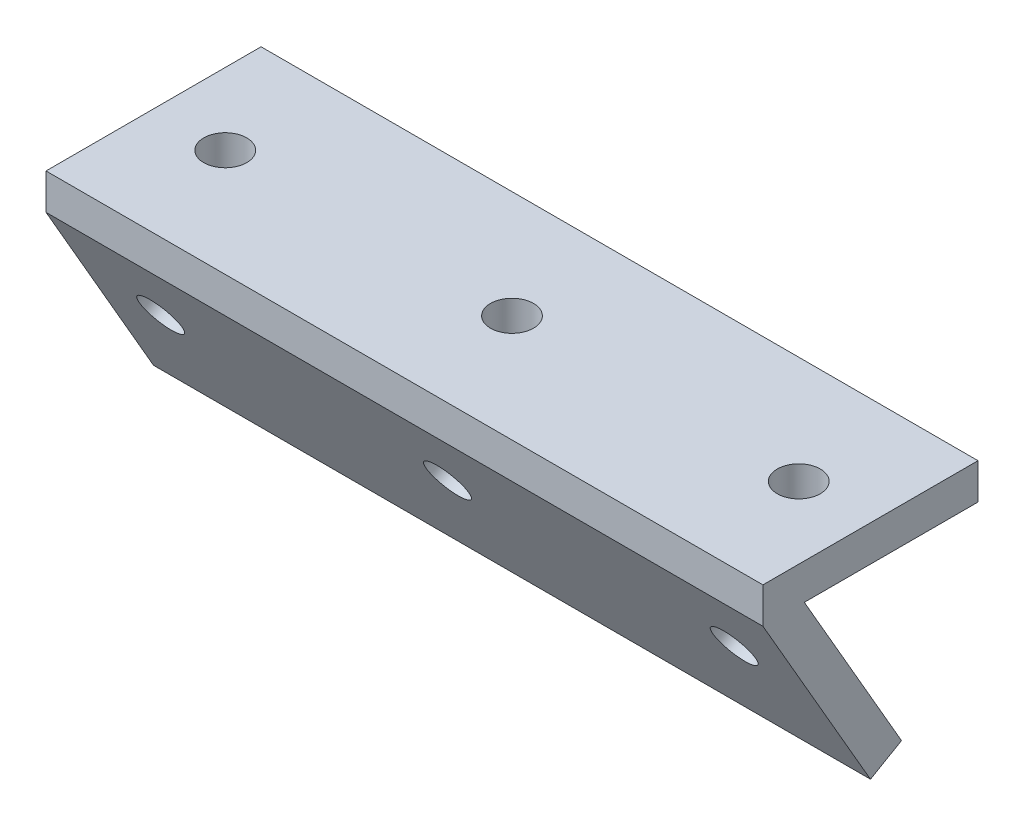
ISO-10303-21;
HEADER;
FILE_DESCRIPTION(('STEP AP214'),'2;1');
FILE_NAME('part.step','',(''),(''),'','','');
FILE_SCHEMA(('AUTOMOTIVE_DESIGN { 1 0 10303 214 1 1 1 1 }'));
ENDSEC;
DATA;
#1=APPLICATION_CONTEXT('core data for automotive mechanical design processes');
#2=APPLICATION_PROTOCOL_DEFINITION('international standard','automotive_design',2000,#1);
#3=PRODUCT_CONTEXT('',#1,'mechanical');
#4=PRODUCT('Part','Part','',(#3));
#5=PRODUCT_RELATED_PRODUCT_CATEGORY('part','',(#4));
#6=PRODUCT_DEFINITION_FORMATION('','',#4);
#7=PRODUCT_DEFINITION_CONTEXT('part definition',#1,'design');
#8=PRODUCT_DEFINITION('design','',#6,#7);
#9=PRODUCT_DEFINITION_SHAPE('','',#8);
#10=(LENGTH_UNIT() NAMED_UNIT(*) SI_UNIT(.MILLI.,.METRE.));
#11=(NAMED_UNIT(*) PLANE_ANGLE_UNIT() SI_UNIT($,.RADIAN.));
#12=(NAMED_UNIT(*) SI_UNIT($,.STERADIAN.) SOLID_ANGLE_UNIT());
#13=UNCERTAINTY_MEASURE_WITH_UNIT(LENGTH_MEASURE(1.E-05),#10,'distance_accuracy_value','');
#14=(GEOMETRIC_REPRESENTATION_CONTEXT(3) GLOBAL_UNCERTAINTY_ASSIGNED_CONTEXT((#13)) GLOBAL_UNIT_ASSIGNED_CONTEXT((#10,
#11,#12)) REPRESENTATION_CONTEXT('',''));
#15=CARTESIAN_POINT('',(0.,0.,0.));
#16=DIRECTION('',(0.,0.,1.));
#17=DIRECTION('',(1.,0.,0.));
#18=AXIS2_PLACEMENT_3D('',#15,#16,#17);
#19=CARTESIAN_POINT('',(0.,-0.0001,0.));
#20=DIRECTION('',(0.,-1.,0.));
#21=DIRECTION('',(0.,0.,-1.));
#22=AXIS2_PLACEMENT_3D('',#19,#20,#21);
#23=PLANE('',#22);
#24=CARTESIAN_POINT('',(-40.,-0.0001,0.));
#25=DIRECTION('',(0.,-1.,0.));
#26=DIRECTION('',(0.,0.,-1.));
#27=AXIS2_PLACEMENT_3D('',#24,#25,#26);
#28=CIRCLE('',#27,3.);
#29=CARTESIAN_POINT('',(-40.,-0.0001,-3.00000000000001));
#30=VERTEX_POINT('',#29);
#31=EDGE_CURVE('E173',#30,#30,#28,.T.);
#32=ORIENTED_EDGE('',*,*,#31,.F.);
#33=EDGE_LOOP('',(#32));
#34=FACE_BOUND('',#33,.T.);
#35=CARTESIAN_POINT('',(40.,-0.0001,0.));
#36=DIRECTION('',(0.,-1.,0.));
#37=DIRECTION('',(0.,0.,-1.));
#38=AXIS2_PLACEMENT_3D('',#35,#36,#37);
#39=CIRCLE('',#38,3.);
#40=CARTESIAN_POINT('',(40.,-0.0001,-3.));
#41=VERTEX_POINT('',#40);
#42=EDGE_CURVE('E177',#41,#41,#39,.T.);
#43=ORIENTED_EDGE('',*,*,#42,.F.);
#44=EDGE_LOOP('',(#43));
#45=FACE_BOUND('',#44,.T.);
#46=CARTESIAN_POINT('',(0.,-0.0001,0.));
#47=DIRECTION('',(0.,-1.,0.));
#48=DIRECTION('',(0.,0.,-1.));
#49=AXIS2_PLACEMENT_3D('',#46,#47,#48);
#50=CIRCLE('',#49,3.);
#51=CARTESIAN_POINT('',(0.,-0.0001,-3.));
#52=VERTEX_POINT('',#51);
#53=EDGE_CURVE('E160',#52,#52,#50,.T.);
#54=ORIENTED_EDGE('',*,*,#53,.F.);
#55=EDGE_LOOP('',(#54));
#56=FACE_BOUND('',#55,.T.);
#57=DIRECTION('',(0.,0.,-1.));
#58=VECTOR('',#57,1.);
#59=CARTESIAN_POINT('',(50.,-0.0001,15.));
#60=LINE('',#59,#58);
#61=CARTESIAN_POINT('',(50.,-9.99999999994061E-05,9.22638183804991));
#62=VERTEX_POINT('',#61);
#63=CARTESIAN_POINT('',(50.,-0.0001,-15.));
#64=VERTEX_POINT('',#63);
#65=EDGE_CURVE('E64',#62,#64,#60,.T.);
#66=ORIENTED_EDGE('',*,*,#65,.F.);
#67=DIRECTION('',(-1.,0.,0.));
#68=VECTOR('',#67,1.);
#69=CARTESIAN_POINT('',(0.,-0.0001,9.22638183804991));
#70=LINE('',#69,#68);
#71=CARTESIAN_POINT('',(-50.,-0.0001,9.22638183804991));
#72=VERTEX_POINT('',#71);
#73=EDGE_CURVE('E11',#62,#72,#70,.T.);
#74=ORIENTED_EDGE('',*,*,#73,.T.);
#75=DIRECTION('',(0.,0.,-1.));
#76=VECTOR('',#75,1.);
#77=CARTESIAN_POINT('',(-50.,-0.0001,15.));
#78=LINE('',#77,#76);
#79=CARTESIAN_POINT('',(-50.,-0.0001,-15.));
#80=VERTEX_POINT('',#79);
#81=EDGE_CURVE('E104',#72,#80,#78,.T.);
#82=ORIENTED_EDGE('',*,*,#81,.T.);
#83=DIRECTION('',(1.,0.,0.));
#84=VECTOR('',#83,1.);
#85=CARTESIAN_POINT('',(-50.,-0.0001,-15.));
#86=LINE('',#85,#84);
#87=EDGE_CURVE('E143',#80,#64,#86,.T.);
#88=ORIENTED_EDGE('',*,*,#87,.T.);
#89=EDGE_LOOP('',(#66,#74,#82,#88));
#90=FACE_BOUND('',#89,.T.);
#91=ADVANCED_FACE('F40',(#34,#45,#56,#90),#23,.T.);
#92=CARTESIAN_POINT('',(-50.,-0.0001,15.));
#93=DIRECTION('',(1.,0.,0.));
#94=DIRECTION('',(0.,0.,-1.));
#95=AXIS2_PLACEMENT_3D('',#92,#93,#94);
#96=PLANE('',#95);
#97=DIRECTION('',(0.,-0.86602540378444,-0.499999999999998));
#98=VECTOR('',#97,1.);
#99=CARTESIAN_POINT('',(-50.,-9.99999999997029E-05,15.));
#100=LINE('',#99,#98);
#101=CARTESIAN_POINT('',(-50.,-9.99999999997029E-05,15.));
#102=VERTEX_POINT('',#101);
#103=CARTESIAN_POINT('',(-50.,-25.9808621135332,0.));
#104=VERTEX_POINT('',#103);
#105=EDGE_CURVE('E121',#102,#104,#100,.T.);
#106=ORIENTED_EDGE('',*,*,#105,.F.);
#107=DIRECTION('',(0.,1.,0.));
#108=VECTOR('',#107,1.);
#109=CARTESIAN_POINT('',(-50.,-0.0001,15.));
#110=LINE('',#109,#108);
#111=CARTESIAN_POINT('',(-50.,5.,15.));
#112=VERTEX_POINT('',#111);
#113=EDGE_CURVE('E149',#102,#112,#110,.T.);
#114=ORIENTED_EDGE('',*,*,#113,.T.);
#115=DIRECTION('',(0.,0.,-1.));
#116=VECTOR('',#115,1.);
#117=CARTESIAN_POINT('',(-50.,5.,15.));
#118=LINE('',#117,#116);
#119=CARTESIAN_POINT('',(-50.,5.,-15.));
#120=VERTEX_POINT('',#119);
#121=EDGE_CURVE('E114',#112,#120,#118,.T.);
#122=ORIENTED_EDGE('',*,*,#121,.T.);
#123=DIRECTION('',(0.,1.,0.));
#124=VECTOR('',#123,1.);
#125=CARTESIAN_POINT('',(-50.,-0.0001,-15.));
#126=LINE('',#125,#124);
#127=EDGE_CURVE('E49',#80,#120,#126,.T.);
#128=ORIENTED_EDGE('',*,*,#127,.F.);
#129=ORIENTED_EDGE('',*,*,#81,.F.);
#130=DIRECTION('',(0.,-0.86602540378444,-0.499999999999998));
#131=VECTOR('',#130,1.);
#132=CARTESIAN_POINT('',(-50.,2.49994999999999,10.6697863785374));
#133=LINE('',#132,#131);
#134=CARTESIAN_POINT('',(-50.,-23.4808121135332,-4.33021362146252));
#135=VERTEX_POINT('',#134);
#136=EDGE_CURVE('E57',#72,#135,#133,.T.);
#137=ORIENTED_EDGE('',*,*,#136,.T.);
#138=DIRECTION('',(0.,0.499999999999998,-0.86602540378444));
#139=VECTOR('',#138,1.);
#140=CARTESIAN_POINT('',(-50.,-25.9808621135332,0.));
#141=LINE('',#140,#139);
#142=EDGE_CURVE('E102',#104,#135,#141,.T.);
#143=ORIENTED_EDGE('',*,*,#142,.F.);
#144=EDGE_LOOP('',(#106,#114,#122,#128,#129,#137,#143));
#145=FACE_BOUND('',#144,.T.);
#146=ADVANCED_FACE('F42',(#145),#96,.F.);
#147=CARTESIAN_POINT('',(-50.,-0.0001,-15.));
#148=DIRECTION('',(0.,0.,1.));
#149=DIRECTION('',(1.,0.,0.));
#150=AXIS2_PLACEMENT_3D('',#147,#148,#149);
#151=PLANE('',#150);
#152=ORIENTED_EDGE('',*,*,#127,.T.);
#153=DIRECTION('',(1.,0.,0.));
#154=VECTOR('',#153,1.);
#155=CARTESIAN_POINT('',(-50.,5.,-15.));
#156=LINE('',#155,#154);
#157=CARTESIAN_POINT('',(50.,5.,-15.));
#158=VERTEX_POINT('',#157);
#159=EDGE_CURVE('E133',#120,#158,#156,.T.);
#160=ORIENTED_EDGE('',*,*,#159,.T.);
#161=DIRECTION('',(0.,1.,0.));
#162=VECTOR('',#161,1.);
#163=CARTESIAN_POINT('',(50.,-0.0001,-15.));
#164=LINE('',#163,#162);
#165=EDGE_CURVE('E153',#64,#158,#164,.T.);
#166=ORIENTED_EDGE('',*,*,#165,.F.);
#167=ORIENTED_EDGE('',*,*,#87,.F.);
#168=EDGE_LOOP('',(#152,#160,#166,#167));
#169=FACE_BOUND('',#168,.T.);
#170=ADVANCED_FACE('F197',(#169),#151,.F.);
#171=CARTESIAN_POINT('',(50.,-0.0001,15.));
#172=DIRECTION('',(1.,0.,0.));
#173=DIRECTION('',(0.,0.,-1.));
#174=AXIS2_PLACEMENT_3D('',#171,#172,#173);
#175=PLANE('',#174);
#176=DIRECTION('',(0.,1.,0.));
#177=VECTOR('',#176,1.);
#178=CARTESIAN_POINT('',(50.,-0.0001,15.));
#179=LINE('',#178,#177);
#180=CARTESIAN_POINT('',(50.,-9.99999999997029E-05,15.));
#181=VERTEX_POINT('',#180);
#182=CARTESIAN_POINT('',(50.,5.,15.));
#183=VERTEX_POINT('',#182);
#184=EDGE_CURVE('E151',#181,#183,#179,.T.);
#185=ORIENTED_EDGE('',*,*,#184,.F.);
#186=DIRECTION('',(0.,-0.86602540378444,-0.499999999999998));
#187=VECTOR('',#186,1.);
#188=CARTESIAN_POINT('',(50.,-9.99999999997029E-05,15.));
#189=LINE('',#188,#187);
#190=CARTESIAN_POINT('',(50.,-25.9808621135332,0.));
#191=VERTEX_POINT('',#190);
#192=EDGE_CURVE('E127',#181,#191,#189,.T.);
#193=ORIENTED_EDGE('',*,*,#192,.T.);
#194=DIRECTION('',(0.,0.499999999999998,-0.86602540378444));
#195=VECTOR('',#194,1.);
#196=CARTESIAN_POINT('',(50.,-25.9808621135332,0.));
#197=LINE('',#196,#195);
#198=CARTESIAN_POINT('',(50.,-23.4808121135332,-4.33021362146252));
#199=VERTEX_POINT('',#198);
#200=EDGE_CURVE('E115',#191,#199,#197,.T.);
#201=ORIENTED_EDGE('',*,*,#200,.T.);
#202=DIRECTION('',(0.,-0.86602540378444,-0.499999999999998));
#203=VECTOR('',#202,1.);
#204=CARTESIAN_POINT('',(50.,2.49994999999999,10.6697863785374));
#205=LINE('',#204,#203);
#206=EDGE_CURVE('E118',#62,#199,#205,.T.);
#207=ORIENTED_EDGE('',*,*,#206,.F.);
#208=ORIENTED_EDGE('',*,*,#65,.T.);
#209=ORIENTED_EDGE('',*,*,#165,.T.);
#210=DIRECTION('',(0.,0.,-1.));
#211=VECTOR('',#210,1.);
#212=CARTESIAN_POINT('',(50.,5.,15.));
#213=LINE('',#212,#211);
#214=EDGE_CURVE('E136',#183,#158,#213,.T.);
#215=ORIENTED_EDGE('',*,*,#214,.F.);
#216=EDGE_LOOP('',(#185,#193,#201,#207,#208,#209,#215));
#217=FACE_BOUND('',#216,.T.);
#218=ADVANCED_FACE('F201',(#217),#175,.T.);
#219=CARTESIAN_POINT('',(-50.,-0.0001,15.));
#220=DIRECTION('',(0.,0.,1.));
#221=DIRECTION('',(1.,0.,0.));
#222=AXIS2_PLACEMENT_3D('',#219,#220,#221);
#223=PLANE('',#222);
#224=ORIENTED_EDGE('',*,*,#184,.T.);
#225=DIRECTION('',(1.,0.,0.));
#226=VECTOR('',#225,1.);
#227=CARTESIAN_POINT('',(-50.,5.,15.));
#228=LINE('',#227,#226);
#229=EDGE_CURVE('E139',#112,#183,#228,.T.);
#230=ORIENTED_EDGE('',*,*,#229,.F.);
#231=ORIENTED_EDGE('',*,*,#113,.F.);
#232=DIRECTION('',(1.,0.,0.));
#233=VECTOR('',#232,1.);
#234=CARTESIAN_POINT('',(-50.,-0.0001,15.));
#235=LINE('',#234,#233);
#236=EDGE_CURVE('E146',#102,#181,#235,.T.);
#237=ORIENTED_EDGE('',*,*,#236,.T.);
#238=EDGE_LOOP('',(#224,#230,#231,#237));
#239=FACE_BOUND('',#238,.T.);
#240=ADVANCED_FACE('F208',(#239),#223,.T.);
#241=CARTESIAN_POINT('',(0.,5.,0.));
#242=DIRECTION('',(0.,-1.,0.));
#243=DIRECTION('',(0.,0.,-1.));
#244=AXIS2_PLACEMENT_3D('',#241,#242,#243);
#245=PLANE('',#244);
#246=CARTESIAN_POINT('',(-40.,5.,0.));
#247=DIRECTION('',(0.,-1.,0.));
#248=DIRECTION('',(0.,0.,-1.));
#249=AXIS2_PLACEMENT_3D('',#246,#247,#248);
#250=CIRCLE('',#249,3.);
#251=CARTESIAN_POINT('',(-40.,5.,-3.00000000000001));
#252=VERTEX_POINT('',#251);
#253=EDGE_CURVE('E106',#252,#252,#250,.T.);
#254=ORIENTED_EDGE('',*,*,#253,.T.);
#255=EDGE_LOOP('',(#254));
#256=FACE_BOUND('',#255,.T.);
#257=CARTESIAN_POINT('',(40.,5.,0.));
#258=DIRECTION('',(0.,-1.,0.));
#259=DIRECTION('',(0.,0.,-1.));
#260=AXIS2_PLACEMENT_3D('',#257,#258,#259);
#261=CIRCLE('',#260,3.);
#262=CARTESIAN_POINT('',(40.,5.,-3.));
#263=VERTEX_POINT('',#262);
#264=EDGE_CURVE('E159',#263,#263,#261,.T.);
#265=ORIENTED_EDGE('',*,*,#264,.T.);
#266=EDGE_LOOP('',(#265));
#267=FACE_BOUND('',#266,.T.);
#268=CARTESIAN_POINT('',(0.,5.,0.));
#269=DIRECTION('',(0.,-1.,0.));
#270=DIRECTION('',(0.,0.,-1.));
#271=AXIS2_PLACEMENT_3D('',#268,#269,#270);
#272=CIRCLE('',#271,3.);
#273=CARTESIAN_POINT('',(0.,5.,-3.));
#274=VERTEX_POINT('',#273);
#275=EDGE_CURVE('E156',#274,#274,#272,.T.);
#276=ORIENTED_EDGE('',*,*,#275,.T.);
#277=EDGE_LOOP('',(#276));
#278=FACE_BOUND('',#277,.T.);
#279=ORIENTED_EDGE('',*,*,#121,.F.);
#280=ORIENTED_EDGE('',*,*,#229,.T.);
#281=ORIENTED_EDGE('',*,*,#214,.T.);
#282=ORIENTED_EDGE('',*,*,#159,.F.);
#283=EDGE_LOOP('',(#279,#280,#281,#282));
#284=FACE_BOUND('',#283,.T.);
#285=ADVANCED_FACE('F204',(#256,#267,#278,#284),#245,.F.);
#286=CARTESIAN_POINT('',(-50.,-25.9808621135332,0.));
#287=DIRECTION('',(0.,0.86602540378444,0.499999999999998));
#288=DIRECTION('',(0.,-0.499999999999998,0.86602540378444));
#289=AXIS2_PLACEMENT_3D('',#286,#287,#288);
#290=PLANE('',#289);
#291=ORIENTED_EDGE('',*,*,#142,.T.);
#292=DIRECTION('',(1.,0.,0.));
#293=VECTOR('',#292,1.);
#294=CARTESIAN_POINT('',(-50.,-23.4808121135332,-4.33021362146252));
#295=LINE('',#294,#293);
#296=EDGE_CURVE('E105',#135,#199,#295,.T.);
#297=ORIENTED_EDGE('',*,*,#296,.T.);
#298=ORIENTED_EDGE('',*,*,#200,.F.);
#299=DIRECTION('',(1.,0.,0.));
#300=VECTOR('',#299,1.);
#301=CARTESIAN_POINT('',(-50.,-25.9808621135332,0.));
#302=LINE('',#301,#300);
#303=EDGE_CURVE('E112',#104,#191,#302,.T.);
#304=ORIENTED_EDGE('',*,*,#303,.F.);
#305=EDGE_LOOP('',(#291,#297,#298,#304));
#306=FACE_BOUND('',#305,.T.);
#307=ADVANCED_FACE('F110',(#306),#290,.F.);
#308=CARTESIAN_POINT('',(0.,-12.9904810567666,7.50000000000003));
#309=DIRECTION('',(0.,-0.499999999999998,0.86602540378444));
#310=DIRECTION('',(0.,-0.86602540378444,-0.499999999999998));
#311=AXIS2_PLACEMENT_3D('',#308,#309,#310);
#312=PLANE('',#311);
#313=CARTESIAN_POINT('',(40.,-10.3924048454133,9.00000000000003));
#314=DIRECTION('',(0.,-0.499999999999998,0.86602540378444));
#315=DIRECTION('',(0.,-0.86602540378444,-0.499999999999998));
#316=AXIS2_PLACEMENT_3D('',#313,#314,#315);
#317=CIRCLE('',#316,3.);
#318=CARTESIAN_POINT('',(40.,-12.9904810567666,7.50000000000003));
#319=VERTEX_POINT('',#318);
#320=EDGE_CURVE('E168',#319,#319,#317,.T.);
#321=ORIENTED_EDGE('',*,*,#320,.F.);
#322=EDGE_LOOP('',(#321));
#323=FACE_BOUND('',#322,.T.);
#324=CARTESIAN_POINT('',(0.,-10.3924048454133,9.00000000000002));
#325=DIRECTION('',(0.,-0.499999999999998,0.86602540378444));
#326=DIRECTION('',(0.,-0.86602540378444,-0.499999999999998));
#327=AXIS2_PLACEMENT_3D('',#324,#325,#326);
#328=CIRCLE('',#327,3.);
#329=CARTESIAN_POINT('',(0.,-12.9904810567666,7.50000000000003));
#330=VERTEX_POINT('',#329);
#331=EDGE_CURVE('E325',#330,#330,#328,.T.);
#332=ORIENTED_EDGE('',*,*,#331,.F.);
#333=EDGE_LOOP('',(#332));
#334=FACE_BOUND('',#333,.T.);
#335=CARTESIAN_POINT('',(-40.,-10.3924048454133,9.00000000000002));
#336=DIRECTION('',(0.,-0.499999999999998,0.86602540378444));
#337=DIRECTION('',(0.,-0.86602540378444,-0.499999999999998));
#338=AXIS2_PLACEMENT_3D('',#335,#336,#337);
#339=CIRCLE('',#338,3.);
#340=CARTESIAN_POINT('',(-40.,-12.9904810567666,7.50000000000003));
#341=VERTEX_POINT('',#340);
#342=EDGE_CURVE('E328',#341,#341,#339,.T.);
#343=ORIENTED_EDGE('',*,*,#342,.F.);
#344=EDGE_LOOP('',(#343));
#345=FACE_BOUND('',#344,.T.);
#346=ORIENTED_EDGE('',*,*,#105,.T.);
#347=ORIENTED_EDGE('',*,*,#303,.T.);
#348=ORIENTED_EDGE('',*,*,#192,.F.);
#349=ORIENTED_EDGE('',*,*,#236,.F.);
#350=EDGE_LOOP('',(#346,#347,#348,#349));
#351=FACE_BOUND('',#350,.T.);
#352=ADVANCED_FACE('F211',(#323,#334,#345,#351),#312,.T.);
#353=CARTESIAN_POINT('',(0.,-10.4904310567666,3.16978637853745));
#354=DIRECTION('',(0.,-0.499999999999998,0.86602540378444));
#355=DIRECTION('',(0.,-0.86602540378444,-0.499999999999998));
#356=AXIS2_PLACEMENT_3D('',#353,#354,#355);
#357=PLANE('',#356);
#358=CARTESIAN_POINT('',(40.,-7.89235484541329,4.66978637853745));
#359=DIRECTION('',(0.,-0.499999999999998,0.86602540378444));
#360=DIRECTION('',(0.,-0.86602540378444,-0.499999999999998));
#361=AXIS2_PLACEMENT_3D('',#358,#359,#360);
#362=CIRCLE('',#361,3.);
#363=CARTESIAN_POINT('',(40.,-10.4904310567666,3.16978637853745));
#364=VERTEX_POINT('',#363);
#365=EDGE_CURVE('E44',#364,#364,#362,.T.);
#366=ORIENTED_EDGE('',*,*,#365,.T.);
#367=EDGE_LOOP('',(#366));
#368=FACE_BOUND('',#367,.T.);
#369=CARTESIAN_POINT('',(0.,-7.89235484541329,4.66978637853744));
#370=DIRECTION('',(0.,-0.499999999999998,0.86602540378444));
#371=DIRECTION('',(0.,-0.86602540378444,-0.499999999999998));
#372=AXIS2_PLACEMENT_3D('',#369,#370,#371);
#373=CIRCLE('',#372,3.);
#374=CARTESIAN_POINT('',(0.,-10.4904310567666,3.16978637853745));
#375=VERTEX_POINT('',#374);
#376=EDGE_CURVE('E167',#375,#375,#373,.T.);
#377=ORIENTED_EDGE('',*,*,#376,.T.);
#378=EDGE_LOOP('',(#377));
#379=FACE_BOUND('',#378,.T.);
#380=CARTESIAN_POINT('',(-40.,-7.8923548454133,4.66978637853744));
#381=DIRECTION('',(0.,-0.499999999999998,0.86602540378444));
#382=DIRECTION('',(0.,-0.86602540378444,-0.499999999999998));
#383=AXIS2_PLACEMENT_3D('',#380,#381,#382);
#384=CIRCLE('',#383,3.);
#385=CARTESIAN_POINT('',(-40.,-10.4904310567666,3.16978637853745));
#386=VERTEX_POINT('',#385);
#387=EDGE_CURVE('E165',#386,#386,#384,.T.);
#388=ORIENTED_EDGE('',*,*,#387,.T.);
#389=EDGE_LOOP('',(#388));
#390=FACE_BOUND('',#389,.T.);
#391=ORIENTED_EDGE('',*,*,#73,.F.);
#392=ORIENTED_EDGE('',*,*,#206,.T.);
#393=ORIENTED_EDGE('',*,*,#296,.F.);
#394=ORIENTED_EDGE('',*,*,#136,.F.);
#395=EDGE_LOOP('',(#391,#392,#393,#394));
#396=FACE_BOUND('',#395,.T.);
#397=ADVANCED_FACE('F117',(#368,#379,#390,#396),#357,.F.);
#398=CARTESIAN_POINT('',(0.,9.9999,0.));
#399=DIRECTION('',(0.,-1.,0.));
#400=DIRECTION('',(0.,0.,-1.));
#401=AXIS2_PLACEMENT_3D('',#398,#399,#400);
#402=CYLINDRICAL_SURFACE('',#401,3.);
#403=ORIENTED_EDGE('',*,*,#53,.T.);
#404=EDGE_LOOP('',(#403));
#405=FACE_BOUND('',#404,.T.);
#406=ORIENTED_EDGE('',*,*,#275,.F.);
#407=EDGE_LOOP('',(#406));
#408=FACE_BOUND('',#407,.T.);
#409=ADVANCED_FACE('F187',(#405,#408),#402,.F.);
#410=CARTESIAN_POINT('',(40.,9.9999,0.));
#411=DIRECTION('',(0.,-1.,0.));
#412=DIRECTION('',(0.,0.,-1.));
#413=AXIS2_PLACEMENT_3D('',#410,#411,#412);
#414=CYLINDRICAL_SURFACE('',#413,3.);
#415=ORIENTED_EDGE('',*,*,#42,.T.);
#416=EDGE_LOOP('',(#415));
#417=FACE_BOUND('',#416,.T.);
#418=ORIENTED_EDGE('',*,*,#264,.F.);
#419=EDGE_LOOP('',(#418));
#420=FACE_BOUND('',#419,.T.);
#421=ADVANCED_FACE('F262',(#417,#420),#414,.F.);
#422=CARTESIAN_POINT('',(-40.,9.9999,0.));
#423=DIRECTION('',(0.,-1.,0.));
#424=DIRECTION('',(0.,0.,-1.));
#425=AXIS2_PLACEMENT_3D('',#422,#423,#424);
#426=CYLINDRICAL_SURFACE('',#425,3.);
#427=ORIENTED_EDGE('',*,*,#31,.T.);
#428=EDGE_LOOP('',(#427));
#429=FACE_BOUND('',#428,.T.);
#430=ORIENTED_EDGE('',*,*,#253,.F.);
#431=EDGE_LOOP('',(#430));
#432=FACE_BOUND('',#431,.T.);
#433=ADVANCED_FACE('F271',(#429,#432),#426,.F.);
#434=CARTESIAN_POINT('',(-40.,-5.39240484541331,0.339745962155625));
#435=DIRECTION('',(0.,-0.499999999999998,0.86602540378444));
#436=DIRECTION('',(0.,-0.86602540378444,-0.499999999999998));
#437=AXIS2_PLACEMENT_3D('',#434,#435,#436);
#438=CYLINDRICAL_SURFACE('',#437,3.);
#439=ORIENTED_EDGE('',*,*,#342,.T.);
#440=EDGE_LOOP('',(#439));
#441=FACE_BOUND('',#440,.T.);
#442=ORIENTED_EDGE('',*,*,#387,.F.);
#443=EDGE_LOOP('',(#442));
#444=FACE_BOUND('',#443,.T.);
#445=ADVANCED_FACE('F280',(#441,#444),#438,.F.);
#446=CARTESIAN_POINT('',(0.,-5.39240484541331,0.339745962155628));
#447=DIRECTION('',(0.,-0.499999999999998,0.86602540378444));
#448=DIRECTION('',(0.,-0.86602540378444,-0.499999999999998));
#449=AXIS2_PLACEMENT_3D('',#446,#447,#448);
#450=CYLINDRICAL_SURFACE('',#449,3.);
#451=ORIENTED_EDGE('',*,*,#331,.T.);
#452=EDGE_LOOP('',(#451));
#453=FACE_BOUND('',#452,.T.);
#454=ORIENTED_EDGE('',*,*,#376,.F.);
#455=EDGE_LOOP('',(#454));
#456=FACE_BOUND('',#455,.T.);
#457=ADVANCED_FACE('F299',(#453,#456),#450,.F.);
#458=CARTESIAN_POINT('',(40.,-5.3924048454133,0.33974596215563));
#459=DIRECTION('',(0.,-0.499999999999998,0.86602540378444));
#460=DIRECTION('',(0.,-0.86602540378444,-0.499999999999998));
#461=AXIS2_PLACEMENT_3D('',#458,#459,#460);
#462=CYLINDRICAL_SURFACE('',#461,3.);
#463=ORIENTED_EDGE('',*,*,#320,.T.);
#464=EDGE_LOOP('',(#463));
#465=FACE_BOUND('',#464,.T.);
#466=ORIENTED_EDGE('',*,*,#365,.F.);
#467=EDGE_LOOP('',(#466));
#468=FACE_BOUND('',#467,.T.);
#469=ADVANCED_FACE('F309',(#465,#468),#462,.F.);
#470=CLOSED_SHELL('',(#91,#146,#170,#218,#240,#285,#307,#352,#397,#409,#421,#433,#445,#457,#469));
#471=MANIFOLD_SOLID_BREP('B2',#470);
#472=ADVANCED_BREP_SHAPE_REPRESENTATION('',(#18,#471),#14);
#473=SHAPE_DEFINITION_REPRESENTATION(#9,#472);
ENDSEC;
END-ISO-10303-21;
